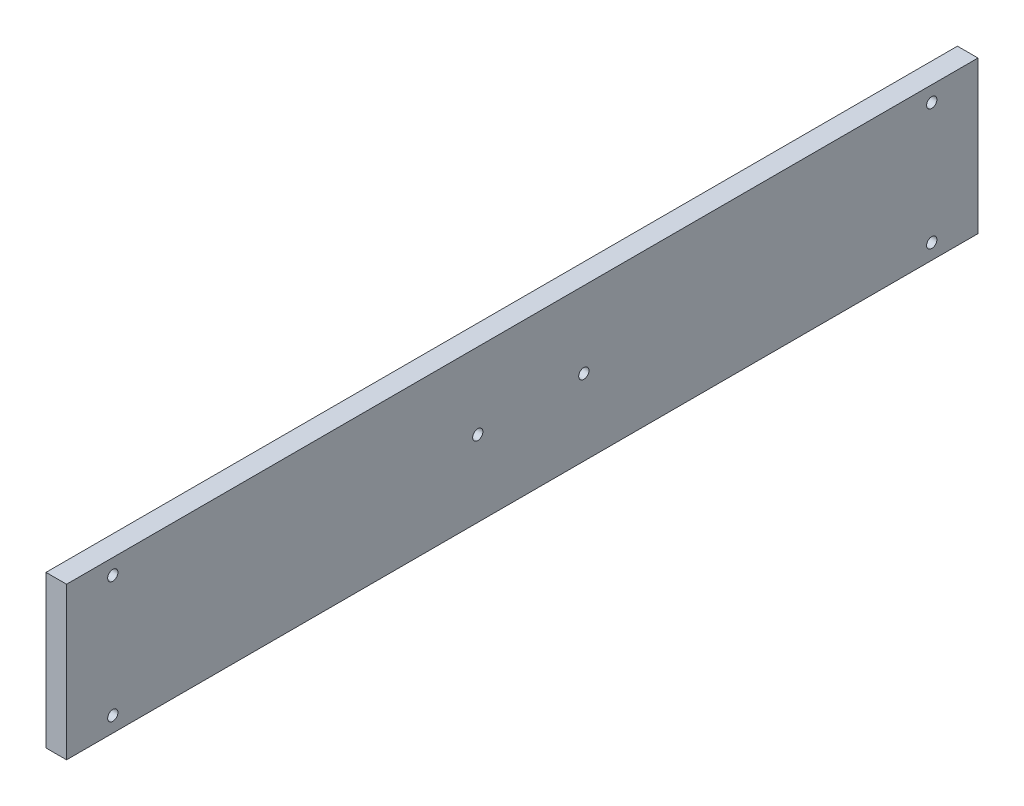
ISO-10303-21;
HEADER;
FILE_DESCRIPTION(('STEP AP214'),'2;1');
FILE_NAME('part.step','',(''),(''),'','','');
FILE_SCHEMA(('AUTOMOTIVE_DESIGN { 1 0 10303 214 1 1 1 1 }'));
ENDSEC;
DATA;
#1=APPLICATION_CONTEXT('core data for automotive mechanical design processes');
#2=APPLICATION_PROTOCOL_DEFINITION('international standard','automotive_design',2000,#1);
#3=PRODUCT_CONTEXT('',#1,'mechanical');
#4=PRODUCT('Part','Part','',(#3));
#5=PRODUCT_RELATED_PRODUCT_CATEGORY('part','',(#4));
#6=PRODUCT_DEFINITION_FORMATION('','',#4);
#7=PRODUCT_DEFINITION_CONTEXT('part definition',#1,'design');
#8=PRODUCT_DEFINITION('design','',#6,#7);
#9=PRODUCT_DEFINITION_SHAPE('','',#8);
#10=(LENGTH_UNIT() NAMED_UNIT(*) SI_UNIT(.MILLI.,.METRE.));
#11=(NAMED_UNIT(*) PLANE_ANGLE_UNIT() SI_UNIT($,.RADIAN.));
#12=(NAMED_UNIT(*) SI_UNIT($,.STERADIAN.) SOLID_ANGLE_UNIT());
#13=UNCERTAINTY_MEASURE_WITH_UNIT(LENGTH_MEASURE(1.E-05),#10,'distance_accuracy_value','');
#14=(GEOMETRIC_REPRESENTATION_CONTEXT(3) GLOBAL_UNCERTAINTY_ASSIGNED_CONTEXT((#13)) GLOBAL_UNIT_ASSIGNED_CONTEXT((#10,
#11,#12)) REPRESENTATION_CONTEXT('',''));
#15=CARTESIAN_POINT('',(0.,0.,0.));
#16=DIRECTION('',(0.,0.,1.));
#17=DIRECTION('',(1.,0.,0.));
#18=AXIS2_PLACEMENT_3D('',#15,#16,#17);
#19=CARTESIAN_POINT('',(10.,37.,75.));
#20=DIRECTION('',(0.,-1.,0.));
#21=DIRECTION('',(0.,0.,-1.));
#22=AXIS2_PLACEMENT_3D('',#19,#20,#21);
#23=PLANE('',#22);
#24=DIRECTION('',(0.,0.,1.));
#25=VECTOR('',#24,1.);
#26=CARTESIAN_POINT('',(0.,37.,75.));
#27=LINE('',#26,#25);
#28=CARTESIAN_POINT('',(0.,37.,-368.402218321902));
#29=VERTEX_POINT('',#28);
#30=CARTESIAN_POINT('',(0.,37.,75.));
#31=VERTEX_POINT('',#30);
#32=EDGE_CURVE('E66',#29,#31,#27,.T.);
#33=ORIENTED_EDGE('',*,*,#32,.T.);
#34=DIRECTION('',(-1.,0.,0.));
#35=VECTOR('',#34,1.);
#36=CARTESIAN_POINT('',(10.,37.,75.));
#37=LINE('',#36,#35);
#38=CARTESIAN_POINT('',(10.,37.,75.));
#39=VERTEX_POINT('',#38);
#40=EDGE_CURVE('E11',#39,#31,#37,.T.);
#41=ORIENTED_EDGE('',*,*,#40,.F.);
#42=DIRECTION('',(0.,0.,1.));
#43=VECTOR('',#42,1.);
#44=CARTESIAN_POINT('',(10.,37.,75.));
#45=LINE('',#44,#43);
#46=CARTESIAN_POINT('',(10.,37.,-368.402218321902));
#47=VERTEX_POINT('',#46);
#48=EDGE_CURVE('E93',#47,#39,#45,.T.);
#49=ORIENTED_EDGE('',*,*,#48,.F.);
#50=DIRECTION('',(1.,0.,0.));
#51=VECTOR('',#50,1.);
#52=CARTESIAN_POINT('',(0.,37.,-368.402218321902));
#53=LINE('',#52,#51);
#54=EDGE_CURVE('E92',#29,#47,#53,.T.);
#55=ORIENTED_EDGE('',*,*,#54,.F.);
#56=EDGE_LOOP('',(#33,#41,#49,#55));
#57=FACE_BOUND('',#56,.T.);
#58=ADVANCED_FACE('F39',(#57),#23,.F.);
#59=CARTESIAN_POINT('',(10.,-37.,75.));
#60=DIRECTION('',(0.,0.,-1.));
#61=DIRECTION('',(-1.,0.,0.));
#62=AXIS2_PLACEMENT_3D('',#59,#60,#61);
#63=PLANE('',#62);
#64=DIRECTION('',(0.,-1.,0.));
#65=VECTOR('',#64,1.);
#66=CARTESIAN_POINT('',(0.,-37.,75.));
#67=LINE('',#66,#65);
#68=CARTESIAN_POINT('',(0.,-37.,75.));
#69=VERTEX_POINT('',#68);
#70=EDGE_CURVE('E88',#31,#69,#67,.T.);
#71=ORIENTED_EDGE('',*,*,#70,.T.);
#72=DIRECTION('',(-1.,0.,0.));
#73=VECTOR('',#72,1.);
#74=CARTESIAN_POINT('',(10.,-37.,75.));
#75=LINE('',#74,#73);
#76=CARTESIAN_POINT('',(10.,-37.,75.));
#77=VERTEX_POINT('',#76);
#78=EDGE_CURVE('E47',#77,#69,#75,.T.);
#79=ORIENTED_EDGE('',*,*,#78,.F.);
#80=DIRECTION('',(0.,-1.,0.));
#81=VECTOR('',#80,1.);
#82=CARTESIAN_POINT('',(10.,-37.,75.));
#83=LINE('',#82,#81);
#84=EDGE_CURVE('E55',#39,#77,#83,.T.);
#85=ORIENTED_EDGE('',*,*,#84,.F.);
#86=ORIENTED_EDGE('',*,*,#40,.T.);
#87=EDGE_LOOP('',(#71,#79,#85,#86));
#88=FACE_BOUND('',#87,.T.);
#89=ADVANCED_FACE('F117',(#88),#63,.F.);
#90=CARTESIAN_POINT('',(10.,-37.,75.));
#91=DIRECTION('',(0.,1.,0.));
#92=DIRECTION('',(0.,0.,1.));
#93=AXIS2_PLACEMENT_3D('',#90,#91,#92);
#94=PLANE('',#93);
#95=DIRECTION('',(0.,0.,-1.));
#96=VECTOR('',#95,1.);
#97=CARTESIAN_POINT('',(0.,-37.,75.));
#98=LINE('',#97,#96);
#99=CARTESIAN_POINT('',(0.,-37.,-368.402218321902));
#100=VERTEX_POINT('',#99);
#101=EDGE_CURVE('E74',#69,#100,#98,.T.);
#102=ORIENTED_EDGE('',*,*,#101,.T.);
#103=DIRECTION('',(-1.,0.,0.));
#104=VECTOR('',#103,1.);
#105=CARTESIAN_POINT('',(0.,-37.,-368.402218321902));
#106=LINE('',#105,#104);
#107=CARTESIAN_POINT('',(10.,-37.,-368.402218321902));
#108=VERTEX_POINT('',#107);
#109=EDGE_CURVE('E89',#108,#100,#106,.T.);
#110=ORIENTED_EDGE('',*,*,#109,.F.);
#111=DIRECTION('',(0.,0.,-1.));
#112=VECTOR('',#111,1.);
#113=CARTESIAN_POINT('',(10.,-37.,75.));
#114=LINE('',#113,#112);
#115=EDGE_CURVE('E111',#77,#108,#114,.T.);
#116=ORIENTED_EDGE('',*,*,#115,.F.);
#117=ORIENTED_EDGE('',*,*,#78,.T.);
#118=EDGE_LOOP('',(#102,#110,#116,#117));
#119=FACE_BOUND('',#118,.T.);
#120=ADVANCED_FACE('F115',(#119),#94,.F.);
#121=CARTESIAN_POINT('',(10.,0.,0.));
#122=DIRECTION('',(-1.,0.,0.));
#123=DIRECTION('',(0.,0.,1.));
#124=AXIS2_PLACEMENT_3D('',#121,#122,#123);
#125=PLANE('',#124);
#126=CARTESIAN_POINT('',(10.,7.46113240635005E-11,-125.052041028867));
#127=DIRECTION('',(-1.,0.,0.));
#128=DIRECTION('',(0.,0.,1.));
#129=AXIS2_PLACEMENT_3D('',#126,#127,#128);
#130=CIRCLE('',#129,2.5);
#131=CARTESIAN_POINT('',(10.,7.46113240635005E-11,-122.552041028867));
#132=VERTEX_POINT('',#131);
#133=EDGE_CURVE('E162',#132,#132,#130,.T.);
#134=ORIENTED_EDGE('',*,*,#133,.T.);
#135=EDGE_LOOP('',(#134));
#136=FACE_BOUND('',#135,.T.);
#137=CARTESIAN_POINT('',(10.,-7.47110706633691E-11,-176.647958971133));
#138=DIRECTION('',(-1.,0.,0.));
#139=DIRECTION('',(0.,0.,1.));
#140=AXIS2_PLACEMENT_3D('',#137,#138,#139);
#141=CIRCLE('',#140,2.5);
#142=CARTESIAN_POINT('',(10.,-7.47110706633691E-11,-174.147958971133));
#143=VERTEX_POINT('',#142);
#144=EDGE_CURVE('E166',#143,#143,#141,.T.);
#145=ORIENTED_EDGE('',*,*,#144,.T.);
#146=EDGE_LOOP('',(#145));
#147=FACE_BOUND('',#146,.T.);
#148=CARTESIAN_POINT('',(10.,-29.5,-345.902218321902));
#149=DIRECTION('',(-1.,0.,0.));
#150=DIRECTION('',(0.,0.,1.));
#151=AXIS2_PLACEMENT_3D('',#148,#149,#150);
#152=CIRCLE('',#151,2.49999999999996);
#153=CARTESIAN_POINT('',(10.,-29.5,-343.402218321902));
#154=VERTEX_POINT('',#153);
#155=EDGE_CURVE('E188',#154,#154,#152,.T.);
#156=ORIENTED_EDGE('',*,*,#155,.T.);
#157=EDGE_LOOP('',(#156));
#158=FACE_BOUND('',#157,.T.);
#159=CARTESIAN_POINT('',(10.,29.5,-345.902218321902));
#160=DIRECTION('',(-1.,0.,0.));
#161=DIRECTION('',(0.,0.,1.));
#162=AXIS2_PLACEMENT_3D('',#159,#160,#161);
#163=CIRCLE('',#162,2.50000000000002);
#164=CARTESIAN_POINT('',(10.,29.5,-343.402218321902));
#165=VERTEX_POINT('',#164);
#166=EDGE_CURVE('E182',#165,#165,#163,.T.);
#167=ORIENTED_EDGE('',*,*,#166,.T.);
#168=EDGE_LOOP('',(#167));
#169=FACE_BOUND('',#168,.T.);
#170=CARTESIAN_POINT('',(10.,29.4999999999993,52.4999999999997));
#171=DIRECTION('',(-1.,0.,0.));
#172=DIRECTION('',(0.,0.,1.));
#173=AXIS2_PLACEMENT_3D('',#170,#171,#172);
#174=CIRCLE('',#173,2.50000000000227);
#175=CARTESIAN_POINT('',(10.,29.4999999999993,55.0000000000019));
#176=VERTEX_POINT('',#175);
#177=EDGE_CURVE('E176',#176,#176,#174,.T.);
#178=ORIENTED_EDGE('',*,*,#177,.T.);
#179=EDGE_LOOP('',(#178));
#180=FACE_BOUND('',#179,.T.);
#181=CARTESIAN_POINT('',(10.,-29.5000000000007,52.4999999999997));
#182=DIRECTION('',(-1.,0.,0.));
#183=DIRECTION('',(0.,0.,1.));
#184=AXIS2_PLACEMENT_3D('',#181,#182,#183);
#185=CIRCLE('',#184,2.50000000000226);
#186=CARTESIAN_POINT('',(10.,-29.5000000000007,55.0000000000019));
#187=VERTEX_POINT('',#186);
#188=EDGE_CURVE('E100',#187,#187,#185,.T.);
#189=ORIENTED_EDGE('',*,*,#188,.T.);
#190=EDGE_LOOP('',(#189));
#191=FACE_BOUND('',#190,.T.);
#192=ORIENTED_EDGE('',*,*,#115,.T.);
#193=DIRECTION('',(0.,-1.,0.));
#194=VECTOR('',#193,1.);
#195=CARTESIAN_POINT('',(10.,37.,-368.402218321902));
#196=LINE('',#195,#194);
#197=EDGE_CURVE('E97',#47,#108,#196,.T.);
#198=ORIENTED_EDGE('',*,*,#197,.F.);
#199=ORIENTED_EDGE('',*,*,#48,.T.);
#200=ORIENTED_EDGE('',*,*,#84,.T.);
#201=EDGE_LOOP('',(#192,#198,#199,#200));
#202=FACE_BOUND('',#201,.T.);
#203=ADVANCED_FACE('F123',(#136,#147,#158,#169,#180,#191,#202),#125,.F.);
#204=CARTESIAN_POINT('',(0.,0.,0.));
#205=DIRECTION('',(-1.,0.,0.));
#206=DIRECTION('',(0.,0.,1.));
#207=AXIS2_PLACEMENT_3D('',#204,#205,#206);
#208=PLANE('',#207);
#209=CARTESIAN_POINT('',(0.,7.46113240635005E-11,-125.052041028867));
#210=DIRECTION('',(-1.,0.,0.));
#211=DIRECTION('',(0.,0.,1.));
#212=AXIS2_PLACEMENT_3D('',#209,#210,#211);
#213=CIRCLE('',#212,2.5);
#214=CARTESIAN_POINT('',(0.,7.46113240635005E-11,-122.552041028867));
#215=VERTEX_POINT('',#214);
#216=EDGE_CURVE('E165',#215,#215,#213,.T.);
#217=ORIENTED_EDGE('',*,*,#216,.F.);
#218=EDGE_LOOP('',(#217));
#219=FACE_BOUND('',#218,.T.);
#220=CARTESIAN_POINT('',(0.,-7.47110706633691E-11,-176.647958971133));
#221=DIRECTION('',(-1.,0.,0.));
#222=DIRECTION('',(0.,0.,1.));
#223=AXIS2_PLACEMENT_3D('',#220,#221,#222);
#224=CIRCLE('',#223,2.5);
#225=CARTESIAN_POINT('',(0.,-7.47110706633691E-11,-174.147958971133));
#226=VERTEX_POINT('',#225);
#227=EDGE_CURVE('E171',#226,#226,#224,.T.);
#228=ORIENTED_EDGE('',*,*,#227,.F.);
#229=EDGE_LOOP('',(#228));
#230=FACE_BOUND('',#229,.T.);
#231=CARTESIAN_POINT('',(0.,-29.5,-345.902218321902));
#232=DIRECTION('',(-1.,0.,0.));
#233=DIRECTION('',(0.,0.,1.));
#234=AXIS2_PLACEMENT_3D('',#231,#232,#233);
#235=CIRCLE('',#234,2.49999999999996);
#236=CARTESIAN_POINT('',(0.,-29.5,-343.402218321902));
#237=VERTEX_POINT('',#236);
#238=EDGE_CURVE('E168',#237,#237,#235,.T.);
#239=ORIENTED_EDGE('',*,*,#238,.F.);
#240=EDGE_LOOP('',(#239));
#241=FACE_BOUND('',#240,.T.);
#242=CARTESIAN_POINT('',(0.,29.5,-345.902218321902));
#243=DIRECTION('',(-1.,0.,0.));
#244=DIRECTION('',(0.,0.,1.));
#245=AXIS2_PLACEMENT_3D('',#242,#243,#244);
#246=CIRCLE('',#245,2.50000000000002);
#247=CARTESIAN_POINT('',(0.,29.5,-343.402218321902));
#248=VERTEX_POINT('',#247);
#249=EDGE_CURVE('E185',#248,#248,#246,.T.);
#250=ORIENTED_EDGE('',*,*,#249,.F.);
#251=EDGE_LOOP('',(#250));
#252=FACE_BOUND('',#251,.T.);
#253=CARTESIAN_POINT('',(0.,29.4999999999993,52.4999999999997));
#254=DIRECTION('',(-1.,0.,0.));
#255=DIRECTION('',(0.,0.,1.));
#256=AXIS2_PLACEMENT_3D('',#253,#254,#255);
#257=CIRCLE('',#256,2.50000000000227);
#258=CARTESIAN_POINT('',(0.,29.4999999999993,55.0000000000019));
#259=VERTEX_POINT('',#258);
#260=EDGE_CURVE('E179',#259,#259,#257,.T.);
#261=ORIENTED_EDGE('',*,*,#260,.F.);
#262=EDGE_LOOP('',(#261));
#263=FACE_BOUND('',#262,.T.);
#264=CARTESIAN_POINT('',(0.,-29.5000000000007,52.4999999999997));
#265=DIRECTION('',(-1.,0.,0.));
#266=DIRECTION('',(0.,0.,1.));
#267=AXIS2_PLACEMENT_3D('',#264,#265,#266);
#268=CIRCLE('',#267,2.50000000000226);
#269=CARTESIAN_POINT('',(0.,-29.5000000000007,55.0000000000019));
#270=VERTEX_POINT('',#269);
#271=EDGE_CURVE('E103',#270,#270,#268,.T.);
#272=ORIENTED_EDGE('',*,*,#271,.F.);
#273=EDGE_LOOP('',(#272));
#274=FACE_BOUND('',#273,.T.);
#275=ORIENTED_EDGE('',*,*,#32,.F.);
#276=DIRECTION('',(0.,1.,0.));
#277=VECTOR('',#276,1.);
#278=CARTESIAN_POINT('',(0.,37.,-368.402218321902));
#279=LINE('',#278,#277);
#280=EDGE_CURVE('E87',#100,#29,#279,.T.);
#281=ORIENTED_EDGE('',*,*,#280,.F.);
#282=ORIENTED_EDGE('',*,*,#101,.F.);
#283=ORIENTED_EDGE('',*,*,#70,.F.);
#284=EDGE_LOOP('',(#275,#281,#282,#283));
#285=FACE_BOUND('',#284,.T.);
#286=ADVANCED_FACE('F85',(#219,#230,#241,#252,#263,#274,#285),#208,.T.);
#287=CARTESIAN_POINT('',(0.,0.,-368.402218321902));
#288=DIRECTION('',(0.,0.,1.));
#289=DIRECTION('',(1.,0.,0.));
#290=AXIS2_PLACEMENT_3D('',#287,#288,#289);
#291=PLANE('',#290);
#292=ORIENTED_EDGE('',*,*,#280,.T.);
#293=ORIENTED_EDGE('',*,*,#54,.T.);
#294=ORIENTED_EDGE('',*,*,#197,.T.);
#295=ORIENTED_EDGE('',*,*,#109,.T.);
#296=EDGE_LOOP('',(#292,#293,#294,#295));
#297=FACE_BOUND('',#296,.T.);
#298=ADVANCED_FACE('F99',(#297),#291,.F.);
#299=CARTESIAN_POINT('',(10.,-29.5000000000007,52.4999999999997));
#300=DIRECTION('',(-1.,0.,0.));
#301=DIRECTION('',(0.,0.,1.));
#302=AXIS2_PLACEMENT_3D('',#299,#300,#301);
#303=CYLINDRICAL_SURFACE('',#302,2.50000000000226);
#304=ORIENTED_EDGE('',*,*,#188,.F.);
#305=EDGE_LOOP('',(#304));
#306=FACE_BOUND('',#305,.T.);
#307=ORIENTED_EDGE('',*,*,#271,.T.);
#308=EDGE_LOOP('',(#307));
#309=FACE_BOUND('',#308,.T.);
#310=ADVANCED_FACE('F134',(#306,#309),#303,.F.);
#311=CARTESIAN_POINT('',(10.,29.4999999999993,52.4999999999997));
#312=DIRECTION('',(-1.,0.,0.));
#313=DIRECTION('',(0.,0.,1.));
#314=AXIS2_PLACEMENT_3D('',#311,#312,#313);
#315=CYLINDRICAL_SURFACE('',#314,2.50000000000227);
#316=ORIENTED_EDGE('',*,*,#177,.F.);
#317=EDGE_LOOP('',(#316));
#318=FACE_BOUND('',#317,.T.);
#319=ORIENTED_EDGE('',*,*,#260,.T.);
#320=EDGE_LOOP('',(#319));
#321=FACE_BOUND('',#320,.T.);
#322=ADVANCED_FACE('F137',(#318,#321),#315,.F.);
#323=CARTESIAN_POINT('',(10.,29.5,-345.902218321902));
#324=DIRECTION('',(-1.,0.,0.));
#325=DIRECTION('',(0.,0.,1.));
#326=AXIS2_PLACEMENT_3D('',#323,#324,#325);
#327=CYLINDRICAL_SURFACE('',#326,2.50000000000002);
#328=ORIENTED_EDGE('',*,*,#166,.F.);
#329=EDGE_LOOP('',(#328));
#330=FACE_BOUND('',#329,.T.);
#331=ORIENTED_EDGE('',*,*,#249,.T.);
#332=EDGE_LOOP('',(#331));
#333=FACE_BOUND('',#332,.T.);
#334=ADVANCED_FACE('F143',(#330,#333),#327,.F.);
#335=CARTESIAN_POINT('',(10.,-29.5,-345.902218321902));
#336=DIRECTION('',(-1.,0.,0.));
#337=DIRECTION('',(0.,0.,1.));
#338=AXIS2_PLACEMENT_3D('',#335,#336,#337);
#339=CYLINDRICAL_SURFACE('',#338,2.49999999999996);
#340=ORIENTED_EDGE('',*,*,#155,.F.);
#341=EDGE_LOOP('',(#340));
#342=FACE_BOUND('',#341,.T.);
#343=ORIENTED_EDGE('',*,*,#238,.T.);
#344=EDGE_LOOP('',(#343));
#345=FACE_BOUND('',#344,.T.);
#346=ADVANCED_FACE('F139',(#342,#345),#339,.F.);
#347=CARTESIAN_POINT('',(10.,-7.47110706633691E-11,-176.647958971133));
#348=DIRECTION('',(-1.,0.,0.));
#349=DIRECTION('',(0.,0.,1.));
#350=AXIS2_PLACEMENT_3D('',#347,#348,#349);
#351=CYLINDRICAL_SURFACE('',#350,2.5);
#352=ORIENTED_EDGE('',*,*,#144,.F.);
#353=EDGE_LOOP('',(#352));
#354=FACE_BOUND('',#353,.T.);
#355=ORIENTED_EDGE('',*,*,#227,.T.);
#356=EDGE_LOOP('',(#355));
#357=FACE_BOUND('',#356,.T.);
#358=ADVANCED_FACE('F142',(#354,#357),#351,.F.);
#359=CARTESIAN_POINT('',(10.,7.46113240635005E-11,-125.052041028867));
#360=DIRECTION('',(-1.,0.,0.));
#361=DIRECTION('',(0.,0.,1.));
#362=AXIS2_PLACEMENT_3D('',#359,#360,#361);
#363=CYLINDRICAL_SURFACE('',#362,2.5);
#364=ORIENTED_EDGE('',*,*,#133,.F.);
#365=EDGE_LOOP('',(#364));
#366=FACE_BOUND('',#365,.T.);
#367=ORIENTED_EDGE('',*,*,#216,.T.);
#368=EDGE_LOOP('',(#367));
#369=FACE_BOUND('',#368,.T.);
#370=ADVANCED_FACE('F153',(#366,#369),#363,.F.);
#371=CLOSED_SHELL('',(#58,#89,#120,#203,#286,#298,#310,#322,#334,#346,#358,#370));
#372=MANIFOLD_SOLID_BREP('B2',#371);
#373=ADVANCED_BREP_SHAPE_REPRESENTATION('',(#18,#372),#14);
#374=SHAPE_DEFINITION_REPRESENTATION(#9,#373);
ENDSEC;
END-ISO-10303-21;
